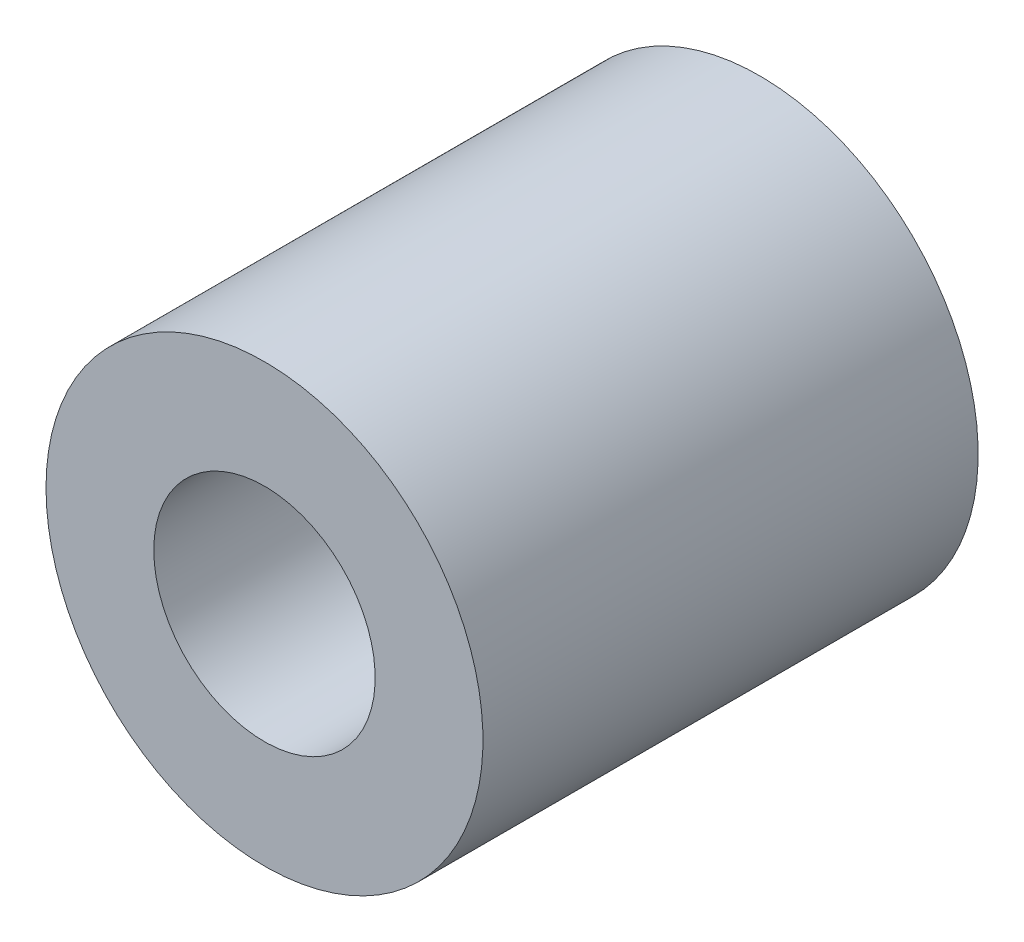
ISO-10303-21;
HEADER;
FILE_DESCRIPTION(('STEP AP214'),'2;1');
FILE_NAME('part.step','',(''),(''),'','','');
FILE_SCHEMA(('AUTOMOTIVE_DESIGN { 1 0 10303 214 1 1 1 1 }'));
ENDSEC;
DATA;
#1=APPLICATION_CONTEXT('core data for automotive mechanical design processes');
#2=APPLICATION_PROTOCOL_DEFINITION('international standard','automotive_design',2000,#1);
#3=PRODUCT_CONTEXT('',#1,'mechanical');
#4=PRODUCT('Part','Part','',(#3));
#5=PRODUCT_RELATED_PRODUCT_CATEGORY('part','',(#4));
#6=PRODUCT_DEFINITION_FORMATION('','',#4);
#7=PRODUCT_DEFINITION_CONTEXT('part definition',#1,'design');
#8=PRODUCT_DEFINITION('design','',#6,#7);
#9=PRODUCT_DEFINITION_SHAPE('','',#8);
#10=(LENGTH_UNIT() NAMED_UNIT(*) SI_UNIT(.MILLI.,.METRE.));
#11=(NAMED_UNIT(*) PLANE_ANGLE_UNIT() SI_UNIT($,.RADIAN.));
#12=(NAMED_UNIT(*) SI_UNIT($,.STERADIAN.) SOLID_ANGLE_UNIT());
#13=UNCERTAINTY_MEASURE_WITH_UNIT(LENGTH_MEASURE(1.E-05),#10,'distance_accuracy_value','');
#14=(GEOMETRIC_REPRESENTATION_CONTEXT(3) GLOBAL_UNCERTAINTY_ASSIGNED_CONTEXT((#13)) GLOBAL_UNIT_ASSIGNED_CONTEXT((#10,
#11,#12)) REPRESENTATION_CONTEXT('',''));
#15=CARTESIAN_POINT('',(0.,0.,0.));
#16=DIRECTION('',(0.,0.,1.));
#17=DIRECTION('',(1.,0.,0.));
#18=AXIS2_PLACEMENT_3D('',#15,#16,#17);
#19=CARTESIAN_POINT('',(0.,0.,21.59));
#20=DIRECTION('',(0.,0.,-1.));
#21=DIRECTION('',(-1.,0.,0.));
#22=AXIS2_PLACEMENT_3D('',#19,#20,#21);
#23=CYLINDRICAL_SURFACE('',#22,4.826);
#24=CARTESIAN_POINT('',(0.,0.,0.));
#25=DIRECTION('',(0.,0.,-1.));
#26=DIRECTION('',(-1.,0.,0.));
#27=AXIS2_PLACEMENT_3D('',#24,#25,#26);
#28=CIRCLE('',#27,4.826);
#29=CARTESIAN_POINT('',(-4.826,0.,0.));
#30=VERTEX_POINT('',#29);
#31=EDGE_CURVE('E24',#30,#30,#28,.T.);
#32=ORIENTED_EDGE('',*,*,#31,.T.);
#33=EDGE_LOOP('',(#32));
#34=FACE_BOUND('',#33,.T.);
#35=CARTESIAN_POINT('',(0.,0.,21.59));
#36=DIRECTION('',(0.,0.,-1.));
#37=DIRECTION('',(-1.,0.,0.));
#38=AXIS2_PLACEMENT_3D('',#35,#36,#37);
#39=CIRCLE('',#38,4.826);
#40=CARTESIAN_POINT('',(-4.826,0.,21.59));
#41=VERTEX_POINT('',#40);
#42=EDGE_CURVE('E15',#41,#41,#39,.T.);
#43=ORIENTED_EDGE('',*,*,#42,.F.);
#44=EDGE_LOOP('',(#43));
#45=FACE_BOUND('',#44,.T.);
#46=ADVANCED_FACE('F12',(#34,#45),#23,.F.);
#47=CARTESIAN_POINT('',(0.,0.,21.59));
#48=DIRECTION('',(0.,0.,1.));
#49=DIRECTION('',(1.,0.,0.));
#50=AXIS2_PLACEMENT_3D('',#47,#48,#49);
#51=PLANE('',#50);
#52=ORIENTED_EDGE('',*,*,#42,.T.);
#53=EDGE_LOOP('',(#52));
#54=FACE_BOUND('',#53,.T.);
#55=CARTESIAN_POINT('',(0.,0.,21.59));
#56=DIRECTION('',(0.,0.,-1.));
#57=DIRECTION('',(-1.,0.,0.));
#58=AXIS2_PLACEMENT_3D('',#55,#56,#57);
#59=CIRCLE('',#58,9.525);
#60=CARTESIAN_POINT('',(-9.525,0.,21.59));
#61=VERTEX_POINT('',#60);
#62=EDGE_CURVE('E19',#61,#61,#59,.T.);
#63=ORIENTED_EDGE('',*,*,#62,.F.);
#64=EDGE_LOOP('',(#63));
#65=FACE_BOUND('',#64,.T.);
#66=ADVANCED_FACE('F32',(#54,#65),#51,.T.);
#67=CARTESIAN_POINT('',(0.,0.,0.));
#68=DIRECTION('',(0.,0.,1.));
#69=DIRECTION('',(1.,0.,0.));
#70=AXIS2_PLACEMENT_3D('',#67,#68,#69);
#71=PLANE('',#70);
#72=ORIENTED_EDGE('',*,*,#31,.F.);
#73=EDGE_LOOP('',(#72));
#74=FACE_BOUND('',#73,.T.);
#75=CARTESIAN_POINT('',(0.,0.,0.));
#76=DIRECTION('',(0.,0.,-1.));
#77=DIRECTION('',(-1.,0.,0.));
#78=AXIS2_PLACEMENT_3D('',#75,#76,#77);
#79=CIRCLE('',#78,9.525);
#80=CARTESIAN_POINT('',(-9.525,0.,0.));
#81=VERTEX_POINT('',#80);
#82=EDGE_CURVE('E8',#81,#81,#79,.F.);
#83=ORIENTED_EDGE('',*,*,#82,.F.);
#84=EDGE_LOOP('',(#83));
#85=FACE_BOUND('',#84,.T.);
#86=ADVANCED_FACE('F40',(#74,#85),#71,.F.);
#87=CARTESIAN_POINT('',(0.,0.,21.59));
#88=DIRECTION('',(0.,0.,-1.));
#89=DIRECTION('',(-1.,0.,0.));
#90=AXIS2_PLACEMENT_3D('',#87,#88,#89);
#91=CYLINDRICAL_SURFACE('',#90,9.525);
#92=ORIENTED_EDGE('',*,*,#82,.T.);
#93=EDGE_LOOP('',(#92));
#94=FACE_BOUND('',#93,.T.);
#95=ORIENTED_EDGE('',*,*,#62,.T.);
#96=EDGE_LOOP('',(#95));
#97=FACE_BOUND('',#96,.T.);
#98=ADVANCED_FACE('F41',(#94,#97),#91,.T.);
#99=CLOSED_SHELL('',(#46,#66,#86,#98));
#100=MANIFOLD_SOLID_BREP('B1',#99);
#101=ADVANCED_BREP_SHAPE_REPRESENTATION('',(#18,#100),#14);
#102=SHAPE_DEFINITION_REPRESENTATION(#9,#101);
ENDSEC;
END-ISO-10303-21;
